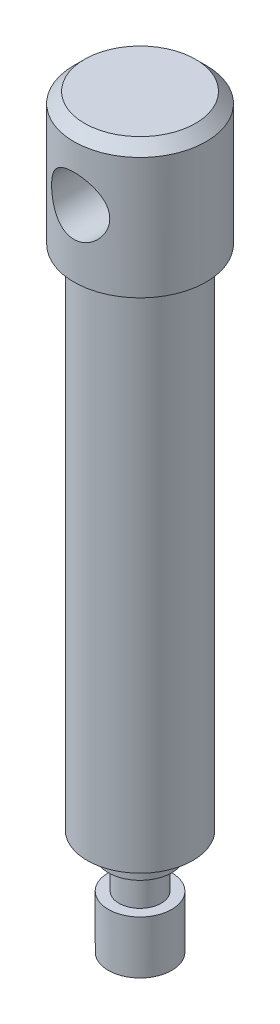
ISO-10303-21;
HEADER;
FILE_DESCRIPTION(('STEP AP214'),'2;1');
FILE_NAME('part.step','',(''),(''),'','','');
FILE_SCHEMA(('AUTOMOTIVE_DESIGN { 1 0 10303 214 1 1 1 1 }'));
ENDSEC;
DATA;
#1=APPLICATION_CONTEXT('core data for automotive mechanical design processes');
#2=APPLICATION_PROTOCOL_DEFINITION('international standard','automotive_design',2000,#1);
#3=PRODUCT_CONTEXT('',#1,'mechanical');
#4=PRODUCT('Part','Part','',(#3));
#5=PRODUCT_RELATED_PRODUCT_CATEGORY('part','',(#4));
#6=PRODUCT_DEFINITION_FORMATION('','',#4);
#7=PRODUCT_DEFINITION_CONTEXT('part definition',#1,'design');
#8=PRODUCT_DEFINITION('design','',#6,#7);
#9=PRODUCT_DEFINITION_SHAPE('','',#8);
#10=(LENGTH_UNIT() NAMED_UNIT(*) SI_UNIT(.MILLI.,.METRE.));
#11=(NAMED_UNIT(*) PLANE_ANGLE_UNIT() SI_UNIT($,.RADIAN.));
#12=(NAMED_UNIT(*) SI_UNIT($,.STERADIAN.) SOLID_ANGLE_UNIT());
#13=UNCERTAINTY_MEASURE_WITH_UNIT(LENGTH_MEASURE(1.E-05),#10,'distance_accuracy_value','');
#14=(GEOMETRIC_REPRESENTATION_CONTEXT(3) GLOBAL_UNCERTAINTY_ASSIGNED_CONTEXT((#13)) GLOBAL_UNIT_ASSIGNED_CONTEXT((#10,
#11,#12)) REPRESENTATION_CONTEXT('',''));
#15=CARTESIAN_POINT('',(0.,0.,0.));
#16=DIRECTION('',(0.,0.,1.));
#17=DIRECTION('',(1.,0.,0.));
#18=AXIS2_PLACEMENT_3D('',#15,#16,#17);
#19=CARTESIAN_POINT('',(0.,0.,0.));
#20=DIRECTION('',(0.,1.,0.));
#21=DIRECTION('',(0.,0.,1.));
#22=AXIS2_PLACEMENT_3D('',#19,#20,#21);
#23=CONICAL_SURFACE('',#22,0.,1.04719755119659);
#24=CARTESIAN_POINT('',(0.,3.4641016151378,0.));
#25=DIRECTION('',(0.,-1.,0.));
#26=DIRECTION('',(0.,0.,-1.));
#27=AXIS2_PLACEMENT_3D('',#24,#25,#26);
#28=CIRCLE('',#27,6.);
#29=CARTESIAN_POINT('',(0.,3.4641016151378,-6.));
#30=VERTEX_POINT('',#29);
#31=EDGE_CURVE('E49',#30,#30,#28,.T.);
#32=ORIENTED_EDGE('',*,*,#31,.T.);
#33=EDGE_LOOP('',(#32));
#34=FACE_BOUND('',#33,.T.);
#35=CARTESIAN_POINT('',(0.,0.,0.));
#36=VERTEX_POINT('',#35);
#37=VERTEX_LOOP('',#36);
#38=FACE_BOUND('',#37,.T.);
#39=ADVANCED_FACE('F30',(#34,#38),#23,.T.);
#40=CARTESIAN_POINT('',(0.,0.,0.));
#41=DIRECTION('',(0.,-1.,0.));
#42=DIRECTION('',(0.,0.,-1.));
#43=AXIS2_PLACEMENT_3D('',#40,#41,#42);
#44=CYLINDRICAL_SURFACE('',#43,6.);
#45=CARTESIAN_POINT('',(0.,13.4641016151378,0.));
#46=DIRECTION('',(0.,-1.,0.));
#47=DIRECTION('',(0.,0.,-1.));
#48=AXIS2_PLACEMENT_3D('',#45,#46,#47);
#49=CIRCLE('',#48,6.);
#50=CARTESIAN_POINT('',(0.,13.4641016151378,-6.));
#51=VERTEX_POINT('',#50);
#52=EDGE_CURVE('E52',#51,#51,#49,.T.);
#53=ORIENTED_EDGE('',*,*,#52,.T.);
#54=EDGE_LOOP('',(#53));
#55=FACE_BOUND('',#54,.T.);
#56=ORIENTED_EDGE('',*,*,#31,.F.);
#57=EDGE_LOOP('',(#56));
#58=FACE_BOUND('',#57,.T.);
#59=ADVANCED_FACE('F40',(#55,#58),#44,.T.);
#60=CARTESIAN_POINT('',(6.,13.4641016151378,0.));
#61=DIRECTION('',(0.,1.,0.));
#62=DIRECTION('',(0.,0.,1.));
#63=AXIS2_PLACEMENT_3D('',#60,#61,#62);
#64=PLANE('',#63);
#65=CARTESIAN_POINT('',(0.,13.4641016151378,0.));
#66=DIRECTION('',(0.,-1.,0.));
#67=DIRECTION('',(0.,0.,-1.));
#68=AXIS2_PLACEMENT_3D('',#65,#66,#67);
#69=CIRCLE('',#68,4.);
#70=CARTESIAN_POINT('',(0.,13.4641016151378,-4.));
#71=VERTEX_POINT('',#70);
#72=EDGE_CURVE('E58',#71,#71,#69,.T.);
#73=ORIENTED_EDGE('',*,*,#72,.T.);
#74=EDGE_LOOP('',(#73));
#75=FACE_BOUND('',#74,.T.);
#76=ORIENTED_EDGE('',*,*,#52,.F.);
#77=EDGE_LOOP('',(#76));
#78=FACE_BOUND('',#77,.T.);
#79=ADVANCED_FACE('F45',(#75,#78),#64,.T.);
#80=CARTESIAN_POINT('',(0.,0.,0.));
#81=DIRECTION('',(0.,-1.,0.));
#82=DIRECTION('',(0.,0.,-1.));
#83=AXIS2_PLACEMENT_3D('',#80,#81,#82);
#84=CYLINDRICAL_SURFACE('',#83,4.);
#85=CARTESIAN_POINT('',(0.,19.4641016151378,0.));
#86=DIRECTION('',(0.,-1.,0.));
#87=DIRECTION('',(0.,0.,-1.));
#88=AXIS2_PLACEMENT_3D('',#85,#86,#87);
#89=CIRCLE('',#88,4.);
#90=CARTESIAN_POINT('',(0.,19.4641016151378,-4.));
#91=VERTEX_POINT('',#90);
#92=EDGE_CURVE('E118',#91,#91,#89,.T.);
#93=ORIENTED_EDGE('',*,*,#92,.T.);
#94=EDGE_LOOP('',(#93));
#95=FACE_BOUND('',#94,.T.);
#96=ORIENTED_EDGE('',*,*,#72,.F.);
#97=EDGE_LOOP('',(#96));
#98=FACE_BOUND('',#97,.T.);
#99=ADVANCED_FACE('F125',(#95,#98),#84,.T.);
#100=CARTESIAN_POINT('',(4.,19.4641016151378,0.));
#101=DIRECTION('',(0.,-1.,0.));
#102=DIRECTION('',(0.,0.,-1.));
#103=AXIS2_PLACEMENT_3D('',#100,#101,#102);
#104=PLANE('',#103);
#105=CARTESIAN_POINT('',(0.,19.4641016151378,0.));
#106=DIRECTION('',(0.,-1.,0.));
#107=DIRECTION('',(0.,0.,-1.));
#108=AXIS2_PLACEMENT_3D('',#105,#106,#107);
#109=CIRCLE('',#108,6.);
#110=CARTESIAN_POINT('',(0.,19.4641016151378,-6.));
#111=VERTEX_POINT('',#110);
#112=EDGE_CURVE('E115',#111,#111,#109,.T.);
#113=ORIENTED_EDGE('',*,*,#112,.T.);
#114=EDGE_LOOP('',(#113));
#115=FACE_BOUND('',#114,.T.);
#116=ORIENTED_EDGE('',*,*,#92,.F.);
#117=EDGE_LOOP('',(#116));
#118=FACE_BOUND('',#117,.T.);
#119=ADVANCED_FACE('F127',(#115,#118),#104,.T.);
#120=CARTESIAN_POINT('',(0.,0.,0.));
#121=DIRECTION('',(0.,-1.,0.));
#122=DIRECTION('',(0.,0.,-1.));
#123=AXIS2_PLACEMENT_3D('',#120,#121,#122);
#124=CYLINDRICAL_SURFACE('',#123,6.);
#125=CARTESIAN_POINT('',(0.,23.4641016151378,0.));
#126=DIRECTION('',(0.,-1.,0.));
#127=DIRECTION('',(0.,0.,-1.));
#128=AXIS2_PLACEMENT_3D('',#125,#126,#127);
#129=CIRCLE('',#128,6.);
#130=CARTESIAN_POINT('',(0.,23.4641016151378,-6.));
#131=VERTEX_POINT('',#130);
#132=EDGE_CURVE('E112',#131,#131,#129,.T.);
#133=ORIENTED_EDGE('',*,*,#132,.T.);
#134=EDGE_LOOP('',(#133));
#135=FACE_BOUND('',#134,.T.);
#136=ORIENTED_EDGE('',*,*,#112,.F.);
#137=EDGE_LOOP('',(#136));
#138=FACE_BOUND('',#137,.T.);
#139=ADVANCED_FACE('F134',(#135,#138),#124,.T.);
#140=CARTESIAN_POINT('',(6.,23.4641016151378,0.));
#141=DIRECTION('',(0.,-1.,0.));
#142=DIRECTION('',(0.,0.,-1.));
#143=AXIS2_PLACEMENT_3D('',#140,#141,#142);
#144=PLANE('',#143);
#145=CARTESIAN_POINT('',(0.,23.4641016151378,0.));
#146=DIRECTION('',(0.,-1.,0.));
#147=DIRECTION('',(0.,0.,-1.));
#148=AXIS2_PLACEMENT_3D('',#145,#146,#147);
#149=CIRCLE('',#148,10.);
#150=CARTESIAN_POINT('',(0.,23.4641016151378,-10.));
#151=VERTEX_POINT('',#150);
#152=EDGE_CURVE('E107',#151,#151,#149,.T.);
#153=ORIENTED_EDGE('',*,*,#152,.T.);
#154=EDGE_LOOP('',(#153));
#155=FACE_BOUND('',#154,.T.);
#156=ORIENTED_EDGE('',*,*,#132,.F.);
#157=EDGE_LOOP('',(#156));
#158=FACE_BOUND('',#157,.T.);
#159=ADVANCED_FACE('F141',(#155,#158),#144,.T.);
#160=CARTESIAN_POINT('',(0.,0.,0.));
#161=DIRECTION('',(0.,-1.,0.));
#162=DIRECTION('',(0.,0.,-1.));
#163=AXIS2_PLACEMENT_3D('',#160,#161,#162);
#164=CYLINDRICAL_SURFACE('',#163,10.);
#165=CARTESIAN_POINT('',(0.,119.464101615138,0.));
#166=DIRECTION('',(0.,-1.,0.));
#167=DIRECTION('',(0.,0.,-1.));
#168=AXIS2_PLACEMENT_3D('',#165,#166,#167);
#169=CIRCLE('',#168,10.);
#170=CARTESIAN_POINT('',(0.,119.464101615138,-10.));
#171=VERTEX_POINT('',#170);
#172=EDGE_CURVE('E104',#171,#171,#169,.T.);
#173=ORIENTED_EDGE('',*,*,#172,.T.);
#174=EDGE_LOOP('',(#173));
#175=FACE_BOUND('',#174,.T.);
#176=ORIENTED_EDGE('',*,*,#152,.F.);
#177=EDGE_LOOP('',(#176));
#178=FACE_BOUND('',#177,.T.);
#179=ADVANCED_FACE('F145',(#175,#178),#164,.T.);
#180=CARTESIAN_POINT('',(10.,119.464101615138,0.));
#181=DIRECTION('',(0.,-1.,0.));
#182=DIRECTION('',(0.,0.,-1.));
#183=AXIS2_PLACEMENT_3D('',#180,#181,#182);
#184=PLANE('',#183);
#185=CARTESIAN_POINT('',(0.,119.464101615138,0.));
#186=DIRECTION('',(0.,-1.,0.));
#187=DIRECTION('',(0.,0.,-1.));
#188=AXIS2_PLACEMENT_3D('',#185,#186,#187);
#189=CIRCLE('',#188,12.5);
#190=CARTESIAN_POINT('',(0.,119.464101615138,-12.5));
#191=VERTEX_POINT('',#190);
#192=EDGE_CURVE('E102',#191,#191,#189,.T.);
#193=ORIENTED_EDGE('',*,*,#192,.T.);
#194=EDGE_LOOP('',(#193));
#195=FACE_BOUND('',#194,.T.);
#196=ORIENTED_EDGE('',*,*,#172,.F.);
#197=EDGE_LOOP('',(#196));
#198=FACE_BOUND('',#197,.T.);
#199=ADVANCED_FACE('F85',(#195,#198),#184,.T.);
#200=CARTESIAN_POINT('',(0.,0.,0.));
#201=DIRECTION('',(0.,-1.,0.));
#202=DIRECTION('',(0.,0.,-1.));
#203=AXIS2_PLACEMENT_3D('',#200,#201,#202);
#204=CYLINDRICAL_SURFACE('',#203,12.5);
#205=CARTESIAN_POINT('',(0.,142.464101615138,0.));
#206=DIRECTION('',(0.,1.,0.));
#207=DIRECTION('',(0.,0.,1.));
#208=AXIS2_PLACEMENT_3D('',#205,#206,#207);
#209=CIRCLE('',#208,12.5);
#210=CARTESIAN_POINT('',(0.,142.464101615138,12.5));
#211=VERTEX_POINT('',#210);
#212=EDGE_CURVE('E36',#211,#211,#209,.F.);
#213=ORIENTED_EDGE('',*,*,#212,.T.);
#214=EDGE_LOOP('',(#213));
#215=FACE_BOUND('',#214,.T.);
#216=CARTESIAN_POINT('',(0.,137.464101615138,-12.5));
#217=CARTESIAN_POINT('',(0.146639382961199,137.46410051969,-12.4999990919958));
#218=CARTESIAN_POINT('',(0.293318154375735,137.458229402566,-12.4974127771437));
#219=CARTESIAN_POINT('',(0.585621654571722,137.434802364007,-12.4871317421033));
#220=CARTESIAN_POINT('',(0.731245720812138,137.417239649683,-12.4794340521813));
#221=CARTESIAN_POINT('',(1.0205725362091,137.370573742282,-12.4591130768074));
#222=CARTESIAN_POINT('',(1.164271093875,137.341448614855,-12.4464804302809));
#223=CARTESIAN_POINT('',(1.44848793570787,137.271954204639,-12.4166145150962));
#224=CARTESIAN_POINT('',(1.58900489436773,137.231580325355,-12.3993793658706));
#225=CARTESIAN_POINT('',(1.86531961969119,137.140168401927,-12.3608234307194));
#226=CARTESIAN_POINT('',(2.00113395618486,137.089173481254,-12.3395191942293));
#227=CARTESIAN_POINT('',(2.26781794521037,136.976882070196,-12.2933054447269));
#228=CARTESIAN_POINT('',(2.39868572339155,136.91558172187,-12.268394582024));
#229=CARTESIAN_POINT('',(2.7825484085992,136.717021299416,-12.1891528370919));
#230=CARTESIAN_POINT('',(3.02715457986596,136.564984391274,-12.1302614080197));
#231=CARTESIAN_POINT('',(3.50004387600374,136.217364938635,-12.0026174358568));
#232=CARTESIAN_POINT('',(3.72689905043988,136.019985008159,-11.9335190381105));
#233=CARTESIAN_POINT('',(4.14565509209934,135.590853911844,-11.7945843685197));
#234=CARTESIAN_POINT('',(4.33753553398595,135.359082803871,-11.7247476905427));
#235=CARTESIAN_POINT('',(4.60042581643017,134.982604807433,-11.6230643669958));
#236=CARTESIAN_POINT('',(4.68578480105142,134.848337597416,-11.5888235337291));
#237=CARTESIAN_POINT('',(4.84480453726133,134.572393911542,-11.5232483525484));
#238=CARTESIAN_POINT('',(4.91847016863593,134.430720559347,-11.4919127945086));
#239=CARTESIAN_POINT('',(5.05346000363175,134.140822916925,-11.4331958999344));
#240=CARTESIAN_POINT('',(5.11478407703122,133.992598557596,-11.4058146051242));
#241=CARTESIAN_POINT('',(5.22443162315176,133.690683729316,-11.3560091071692));
#242=CARTESIAN_POINT('',(5.27276203714546,133.536996228683,-11.3335822584827));
#243=CARTESIAN_POINT('',(5.3537412966475,133.233300525852,-11.2955457027421));
#244=CARTESIAN_POINT('',(5.38706906362718,133.083509896026,-11.2796446029338));
#245=CARTESIAN_POINT('',(5.44112526743264,132.781238592768,-11.2536686806615));
#246=CARTESIAN_POINT('',(5.46185973185658,132.628759242272,-11.2435910709824));
#247=CARTESIAN_POINT('',(5.49047475552749,132.322365919958,-11.2296456624185));
#248=CARTESIAN_POINT('',(5.49835959882679,132.168452443496,-11.2257757938851));
#249=CARTESIAN_POINT('',(5.50117916405868,131.860483126277,-11.2243945175479));
#250=CARTESIAN_POINT('',(5.49611469202428,131.706427294977,-11.226882713985));
#251=CARTESIAN_POINT('',(5.47411929509198,131.412982269901,-11.2376219320427));
#252=CARTESIAN_POINT('',(5.45826761109952,131.273491313424,-11.2453486105443));
#253=CARTESIAN_POINT('',(5.41602008531488,130.996439593445,-11.2657568065911));
#254=CARTESIAN_POINT('',(5.38962082992661,130.858879469769,-11.2784399282011));
#255=CARTESIAN_POINT('',(5.32655490299109,130.586668394901,-11.3083610330218));
#256=CARTESIAN_POINT('',(5.28989035098446,130.452016849334,-11.3255980759143));
#257=CARTESIAN_POINT('',(5.20664408045846,130.186389282142,-11.364108068634));
#258=CARTESIAN_POINT('',(5.16005851967097,130.055414706865,-11.3853825817686));
#259=CARTESIAN_POINT('',(5.00373456797059,129.66350196128,-11.4553883060799));
#260=CARTESIAN_POINT('',(4.87878948855266,129.409423502848,-11.5096215236993));
#261=CARTESIAN_POINT('',(4.59267512645531,128.924911817978,-11.6267428833529));
#262=CARTESIAN_POINT('',(4.43149073032541,128.694488515389,-11.6896346321358));
#263=CARTESIAN_POINT('',(4.0594752691612,128.240560599769,-11.8242722566892));
#264=CARTESIAN_POINT('',(3.84537725977203,128.019806741833,-11.8962908236294));
#265=CARTESIAN_POINT('',(3.38241134031739,127.616287475134,-12.0360945955485));
#266=CARTESIAN_POINT('',(3.13353336140132,127.433533105532,-12.1038785663533));
#267=CARTESIAN_POINT('',(2.73484422896271,127.189594171068,-12.197955635025));
#268=CARTESIAN_POINT('',(2.59555266683755,127.112446307419,-12.2284231149523));
#269=CARTESIAN_POINT('',(2.3101866103929,126.970264442896,-12.2855264277796));
#270=CARTESIAN_POINT('',(2.1641149330268,126.905225466405,-12.312163833452));
#271=CARTESIAN_POINT('',(1.86623540306826,126.787926412109,-12.3608229376582));
#272=CARTESIAN_POINT('',(1.71442915541154,126.735662789009,-12.3828459165011));
#273=CARTESIAN_POINT('',(1.40620435262899,126.644476803321,-12.4216223606231));
#274=CARTESIAN_POINT('',(1.24978619539292,126.605553293459,-12.4383762790407));
#275=CARTESIAN_POINT('',(0.944540398658032,126.543732847631,-12.4651385183824));
#276=CARTESIAN_POINT('',(0.795932182180448,126.519916565833,-12.4755320320676));
#277=CARTESIAN_POINT('',(0.496993254790921,126.484535302618,-12.4910124588164));
#278=CARTESIAN_POINT('',(0.346662652975796,126.472969549536,-12.4960997061237));
#279=CARTESIAN_POINT('',(0.0455158887639267,126.462226995002,-12.500824024475));
#280=CARTESIAN_POINT('',(-0.105300128619766,126.463046784953,-12.5004625950366));
#281=CARTESIAN_POINT('',(-0.406241968417488,126.477057215563,-12.4943033507183));
#282=CARTESIAN_POINT('',(-0.556367809486117,126.490247519863,-12.4885056836515));
#283=CARTESIAN_POINT('',(-0.846230612738622,126.527740739585,-12.472119095482));
#284=CARTESIAN_POINT('',(-0.986072215267376,126.551367818482,-12.4618219233662));
#285=CARTESIAN_POINT('',(-1.26317698191446,126.609250814838,-12.4367900470452));
#286=CARTESIAN_POINT('',(-1.40043929709516,126.643510168961,-12.4220539080804));
#287=CARTESIAN_POINT('',(-1.67142388581645,126.72232322341,-12.3885014383697));
#288=CARTESIAN_POINT('',(-1.80514716883488,126.766873952155,-12.3696862855137));
#289=CARTESIAN_POINT('',(-2.068314722517,126.865879166605,-12.3284167389751));
#290=CARTESIAN_POINT('',(-2.19775733822885,126.920337430971,-12.3059609571402));
#291=CARTESIAN_POINT('',(-2.58637611104931,127.10160451565,-12.232388936427));
#292=CARTESIAN_POINT('',(-2.83756706974256,127.243897436248,-12.1761319220311));
#293=CARTESIAN_POINT('',(-3.31328248718942,127.564708770043,-12.0553981561847));
#294=CARTESIAN_POINT('',(-3.53779531725528,127.743242889198,-11.9909178454989));
#295=CARTESIAN_POINT('',(-3.97266163292822,128.147949308319,-11.8542772885358));
#296=CARTESIAN_POINT('',(-4.18048852552508,128.376773458049,-11.7819130945979));
#297=CARTESIAN_POINT('',(-4.55567668952969,128.867163375305,-11.6419938703006));
#298=CARTESIAN_POINT('',(-4.72302452075205,129.128739973935,-11.5744404424892));
#299=CARTESIAN_POINT('',(-4.94148703001357,129.543981465643,-11.4820792572116));
#300=CARTESIAN_POINT('',(-5.00944997206298,129.687949856389,-11.4525092108172));
#301=CARTESIAN_POINT('',(-5.13287060587781,129.98192819532,-11.3977278403932));
#302=CARTESIAN_POINT('',(-5.18833381352246,130.1319354441,-11.372514594946));
#303=CARTESIAN_POINT('',(-5.28612668824463,130.436851587507,-11.3273901888091));
#304=CARTESIAN_POINT('',(-5.32846374941774,130.591757668173,-11.3074760439801));
#305=CARTESIAN_POINT('',(-5.39951781766005,130.905311773321,-11.2737199274755));
#306=CARTESIAN_POINT('',(-5.4282363204825,131.063959384852,-11.2598772889669));
#307=CARTESIAN_POINT('',(-5.4698406584516,131.370222752668,-11.2397209947267));
#308=CARTESIAN_POINT('',(-5.48384952593483,131.517651802295,-11.232874598439));
#309=CARTESIAN_POINT('',(-5.49992508511318,131.813311698718,-11.2250125531146));
#310=CARTESIAN_POINT('',(-5.5019925144571,131.961542495421,-11.2239965439221));
#311=CARTESIAN_POINT('',(-5.49415973642309,132.257582847785,-11.227832683912));
#312=CARTESIAN_POINT('',(-5.48426164027891,132.405392473148,-11.2326837978814));
#313=CARTESIAN_POINT('',(-5.45262810283322,132.699434208771,-11.2480733680148));
#314=CARTESIAN_POINT('',(-5.43089283022985,132.845666341483,-11.2586117431264));
#315=CARTESIAN_POINT('',(-5.37744521930289,133.127017877087,-11.2842326244912));
#316=CARTESIAN_POINT('',(-5.34638619955303,133.262289174604,-11.2990154135121));
#317=CARTESIAN_POINT('',(-5.27430996899169,133.529620205407,-11.3328385293797));
#318=CARTESIAN_POINT('',(-5.2332895706919,133.661678895799,-11.3518802188548));
#319=CARTESIAN_POINT('',(-5.09581073855196,134.051831468213,-11.4145927043071));
#320=CARTESIAN_POINT('',(-4.9848979175954,134.304092757445,-11.4638695067249));
#321=CARTESIAN_POINT('',(-4.71978063818499,134.802868764878,-11.5756461915238));
#322=CARTESIAN_POINT('',(-4.56327347711196,135.048000215164,-11.6387872605327));
#323=CARTESIAN_POINT('',(-4.21426117353745,135.510051081674,-11.7696489403248));
#324=CARTESIAN_POINT('',(-4.02174138338204,135.726958957251,-11.8373714073501));
#325=CARTESIAN_POINT('',(-3.70026878178454,136.036289219484,-11.9403590807349));
#326=CARTESIAN_POINT('',(-3.58246341285294,136.1403070533,-11.9763161086025));
#327=CARTESIAN_POINT('',(-3.33812094520559,136.338072325032,-12.046704354292));
#328=CARTESIAN_POINT('',(-3.21158694176877,136.431823373468,-12.0811361059547));
#329=CARTESIAN_POINT('',(-2.95037782942927,136.608470187416,-12.1475698075784));
#330=CARTESIAN_POINT('',(-2.8156952563378,136.691355773082,-12.1795694672867));
#331=CARTESIAN_POINT('',(-2.53916491562741,136.845461954057,-12.2402067919168));
#332=CARTESIAN_POINT('',(-2.39732050030487,136.916687941929,-12.2688460092976));
#333=CARTESIAN_POINT('',(-2.10905276459763,137.046085707455,-12.3216522174196));
#334=CARTESIAN_POINT('',(-1.96270298577672,137.104401262763,-12.3458678777071));
#335=CARTESIAN_POINT('',(-1.66496318267277,137.20840779445,-12.3895326281017));
#336=CARTESIAN_POINT('',(-1.51357561837442,137.254104834045,-12.4089840069441));
#337=CARTESIAN_POINT('',(-1.20724269501743,137.332294671118,-12.4425179160448));
#338=CARTESIAN_POINT('',(-1.05230684852083,137.364819203989,-12.4566133448073));
#339=CARTESIAN_POINT('',(-0.739877601012884,137.416405491818,-12.47906540951));
#340=CARTESIAN_POINT('',(-0.582386072594319,137.43547668566,-12.4874260688604));
#341=CARTESIAN_POINT('',(-0.353758373712963,137.453169918252,-12.4951932059168));
#342=CARTESIAN_POINT('',(-0.28308490750393,137.457267787853,-12.4969943952127));
#343=CARTESIAN_POINT('',(-0.14161068987875,137.462733914446,-12.4993980174853));
#344=CARTESIAN_POINT('',(-0.0708099371954935,137.464102144113,-12.5000004384615));
#345=CARTESIAN_POINT('',(0.,137.464101615138,-12.5));
#346=B_SPLINE_CURVE_WITH_KNOTS('',3,(#216,#217,#218,#219,#220,#221,#222,#223,#224,#225,#226,
#227,#228,#229,#230,#231,#232,#233,#234,#235,#236,#237,#238,#239,#240,#241,#242,#243,#244,#245,
#246,#247,#248,#249,#250,#251,#252,#253,#254,#255,#256,#257,#258,#259,#260,#261,#262,#263,#264,
#265,#266,#267,#268,#269,#270,#271,#272,#273,#274,#275,#276,#277,#278,#279,#280,#281,#282,#283,
#284,#285,#286,#287,#288,#289,#290,#291,#292,#293,#294,#295,#296,#297,#298,#299,#300,#301,#302,
#303,#304,#305,#306,#307,#308,#309,#310,#311,#312,#313,#314,#315,#316,#317,#318,#319,#320,#321,
#322,#323,#324,#325,#326,#327,#328,#329,#330,#331,#332,#333,#334,#335,#336,#337,#338,#339,#340,
#341,#342,#343,#344,#345),.UNSPECIFIED.,.T.,.F.,(4,2,2,2,2,2,2,2,2,2,2,2,2,2,2,2,2,2,2,2,2,2,2,
2,2,2,2,2,2,2,2,2,2,2,2,2,2,2,2,2,2,2,2,2,2,2,2,2,2,2,2,2,2,2,2,2,2,2,2,2,2,2,2,2,4),(0.,
0.439846896635045,0.879949570329761,1.32089115648199,1.76201318631245,2.20137792196694,
2.64090750604861,3.51885611338797,4.44070823623367,5.36309701021099,5.85082579480174,
6.3383505057806,6.82588036059962,7.31314925488694,7.77534632926129,8.23732200514072,
8.69914362720426,9.16093650377829,9.58224460334833,10.0036891648679,10.4250467721589,
10.846567863096,11.7075328574956,12.568857581862,13.5122441651813,14.4559044282286,
14.9417259055645,15.4273473130978,15.9128338021932,16.3982785280879,16.8502809850181,
17.30225496843,17.7541045674196,18.2059418808201,18.6320401402669,19.0582762709277,
19.4843894816695,19.9106655508824,20.7889739925331,21.6676638851105,22.6158909492907,
23.5644324206487,24.0496707619813,24.5346945563763,25.0194446332887,25.5041414568011,
25.9483117471379,26.3924545998084,26.8365190979981,27.2805772677447,27.6988256690068,
28.1172080800988,28.9533936994914,29.8427032161916,30.7323752372297,31.2155464216096,
31.6985471398147,32.1819971953139,32.6652230195462,33.1427614141817,33.6200699499873,
34.0962216068891,34.5720388618024,34.7844321405895,34.9968275455443),.UNSPECIFIED.);
#347=CARTESIAN_POINT('',(0.,137.464101615138,-12.5));
#348=VERTEX_POINT('',#347);
#349=EDGE_CURVE('E55',#348,#348,#346,.T.);
#350=ORIENTED_EDGE('',*,*,#349,.F.);
#351=EDGE_LOOP('',(#350));
#352=FACE_BOUND('',#351,.T.);
#353=CARTESIAN_POINT('',(5.5,131.964101615138,11.2249721603218));
#354=CARTESIAN_POINT('',(5.49999884770547,132.109965901957,11.2249734351853));
#355=CARTESIAN_POINT('',(5.49418903021214,132.255872063922,11.2278252005178));
#356=CARTESIAN_POINT('',(5.47101232667634,132.546607565965,11.2391363031221));
#357=CARTESIAN_POINT('',(5.45363845348111,132.691436201459,11.247599030598));
#358=CARTESIAN_POINT('',(5.40748979701105,132.979148501887,11.2698584884825));
#359=CARTESIAN_POINT('',(5.37869231970294,133.122027706094,11.2836658351356));
#360=CARTESIAN_POINT('',(5.31000648388132,133.404582323564,11.3161509316212));
#361=CARTESIAN_POINT('',(5.27011342095027,133.544256350612,11.3348307471225));
#362=CARTESIAN_POINT('',(5.17986046601167,133.818775305694,11.3763569333846));
#363=CARTESIAN_POINT('',(5.12955240006261,133.953640408906,11.3991826074639));
#364=CARTESIAN_POINT('',(5.01880005794709,134.218492887786,11.4483761765637));
#365=CARTESIAN_POINT('',(4.95835190183566,134.348478372956,11.4747454267064));
#366=CARTESIAN_POINT('',(4.76255263964395,134.729897238902,11.5580363005808));
#367=CARTESIAN_POINT('',(4.61263958803655,134.973116034501,11.6191927504623));
#368=CARTESIAN_POINT('',(4.26738460516926,135.447044725358,11.7505589573178));
#369=CARTESIAN_POINT('',(4.0697717815877,135.675994908667,11.8210965384448));
#370=CARTESIAN_POINT('',(3.63923797985084,136.098938110022,11.9606436914299));
#371=CARTESIAN_POINT('',(3.40630251603595,136.29291671461,12.0296526230276));
#372=CARTESIAN_POINT('',(3.02827235286859,136.558110572512,12.1283867246326));
#373=CARTESIAN_POINT('',(2.89397140693482,136.6438894809,12.1612090108564));
#374=CARTESIAN_POINT('',(2.61787727862233,136.80374251872,12.223612581678));
#375=CARTESIAN_POINT('',(2.4760870297448,136.877821186338,12.253195121508));
#376=CARTESIAN_POINT('',(2.18595913598592,137.013580604271,12.308265046126));
#377=CARTESIAN_POINT('',(2.03762259031471,137.075263426424,12.33375311512));
#378=CARTESIAN_POINT('',(1.73544960887244,137.185602876902,12.3798853499406));
#379=CARTESIAN_POINT('',(1.58161360953319,137.234260536302,12.4005298991657));
#380=CARTESIAN_POINT('',(1.27859166635513,137.31558620091,12.4353172963261));
#381=CARTESIAN_POINT('',(1.12964322559774,137.349009742611,12.4497645468914));
#382=CARTESIAN_POINT('',(0.829079946174318,137.403398009801,12.4733854052628));
#383=CARTESIAN_POINT('',(0.67746530278983,137.424363643869,12.4825593976555));
#384=CARTESIAN_POINT('',(0.372838738570998,137.453582114183,12.4953680870592));
#385=CARTESIAN_POINT('',(0.219827351849195,137.461839620701,12.4990048190231));
#386=CARTESIAN_POINT('',(-0.0863778731984319,137.465554090556,12.5006390031796));
#387=CARTESIAN_POINT('',(-0.239571703155749,137.461011620001,12.4986367047713));
#388=CARTESIAN_POINT('',(-0.534479303806771,137.439928399787,12.4893794562587));
#389=CARTESIAN_POINT('',(-0.676265374083268,137.42422450536,12.4824909310266));
#390=CARTESIAN_POINT('',(-0.957938485123453,137.381909490836,12.4640394439173));
#391=CARTESIAN_POINT('',(-1.09782489883098,137.355294855491,12.45247497555));
#392=CARTESIAN_POINT('',(-1.37465605510795,137.291436162477,12.4249613461566));
#393=CARTESIAN_POINT('',(-1.51160175174769,137.254195610007,12.4090136311072));
#394=CARTESIAN_POINT('',(-1.78177859402749,137.169418327041,12.3731098837317));
#395=CARTESIAN_POINT('',(-1.91500830181867,137.12187767178,12.3531523236994));
#396=CARTESIAN_POINT('',(-2.17886809415096,137.016133600499,12.3093734943991));
#397=CARTESIAN_POINT('',(-2.30943016898471,136.957782290779,12.2854992375924));
#398=CARTESIAN_POINT('',(-2.56516043475226,136.831372539882,12.2346632102896));
#399=CARTESIAN_POINT('',(-2.69032663892982,136.76331056233,12.2077003156992));
#400=CARTESIAN_POINT('',(-3.05670718390398,136.545279929948,12.123085226232));
#401=CARTESIAN_POINT('',(-3.28896726484586,136.38140046417,12.0616782883599));
#402=CARTESIAN_POINT('',(-3.74158492320574,136.006816836191,11.9293964202791));
#403=CARTESIAN_POINT('',(-3.95963480197055,135.793472435989,11.8581565384261));
#404=CARTESIAN_POINT('',(-4.35803745928775,135.333086719253,11.7176006760157));
#405=CARTESIAN_POINT('',(-4.53837219266091,135.086029365417,11.6482856301066));
#406=CARTESIAN_POINT('',(-4.78009760449335,134.689178208726,11.5502669073709));
#407=CARTESIAN_POINT('',(-4.85707008524071,134.54952224687,11.5180218695961));
#408=CARTESIAN_POINT('',(-4.99885655428661,134.263423566767,11.4571976088772));
#409=CARTESIAN_POINT('',(-5.06367557981789,134.116983691767,11.4286168687547));
#410=CARTESIAN_POINT('',(-5.18049248677231,133.818340777167,11.3761418586993));
#411=CARTESIAN_POINT('',(-5.23249595997609,133.666140284644,11.3522455457552));
#412=CARTESIAN_POINT('',(-5.32312136116178,133.357049693897,11.3100346345866));
#413=CARTESIAN_POINT('',(-5.36174464974017,133.200160074262,11.2917194688523));
#414=CARTESIAN_POINT('',(-5.42289357245669,132.894077623469,11.2624727039808));
#415=CARTESIAN_POINT('',(-5.44635473954129,132.745112049568,11.2511149231446));
#416=CARTESIAN_POINT('',(-5.48097320846719,132.445431831029,11.2342915427309));
#417=CARTESIAN_POINT('',(-5.49213148998311,132.294717326623,11.2288254739992));
#418=CARTESIAN_POINT('',(-5.50199729955742,131.992835540498,11.2239946642097));
#419=CARTESIAN_POINT('',(-5.50070912098336,131.841668432889,11.2246278192436));
#420=CARTESIAN_POINT('',(-5.48571050348781,131.54010654503,11.2319655074847));
#421=CARTESIAN_POINT('',(-5.47200053317996,131.38971173586,11.2386698116571));
#422=CARTESIAN_POINT('',(-5.43383012851095,131.102181361339,11.257171155604));
#423=CARTESIAN_POINT('',(-5.4102569185629,130.964900110694,11.2685467089964));
#424=CARTESIAN_POINT('',(-5.35289620944869,130.692943068927,11.2959061923654));
#425=CARTESIAN_POINT('',(-5.31910546067424,130.558268121239,11.3118915883913));
#426=CARTESIAN_POINT('',(-5.2028709732722,130.15947953855,11.3660700789536));
#427=CARTESIAN_POINT('',(-5.10553650826352,129.900391351036,11.4105001716331));
#428=CARTESIAN_POINT('',(-4.86926821846438,129.390632704846,11.5133583703101));
#429=CARTESIAN_POINT('',(-4.72867854952625,129.14084743026,11.572320618129));
#430=CARTESIAN_POINT('',(-4.41148815437447,128.667114571596,11.696915567156));
#431=CARTESIAN_POINT('',(-4.23487068436394,128.443179077164,11.7625513627327));
#432=CARTESIAN_POINT('',(-3.8312124717608,128.005788054132,11.9004709177411));
#433=CARTESIAN_POINT('',(-3.60101454340326,127.795230343163,11.9728067054778));
#434=CARTESIAN_POINT('',(-3.23078835688785,127.510298615547,12.0759487782241));
#435=CARTESIAN_POINT('',(-3.1031370291362,127.420425624783,12.1094551568245));
#436=CARTESIAN_POINT('',(-2.84019416391194,127.251600513385,12.1738068638457));
#437=CARTESIAN_POINT('',(-2.70490595907556,127.172643680175,12.2046533383863));
#438=CARTESIAN_POINT('',(-2.42638196271899,127.025714434557,12.2630781800778));
#439=CARTESIAN_POINT('',(-2.28309122062564,126.957835010752,12.2906284097678));
#440=CARTESIAN_POINT('',(-1.99057724073719,126.834503288871,12.3413783678723));
#441=CARTESIAN_POINT('',(-1.84135658709185,126.779045646035,12.3645799666825));
#442=CARTESIAN_POINT('',(-1.53807748217905,126.681138412368,12.4059554620578));
#443=CARTESIAN_POINT('',(-1.38402063334261,126.638684561967,12.4241310047863));
#444=CARTESIAN_POINT('',(-1.07226738648505,126.567268477013,12.4549093538234));
#445=CARTESIAN_POINT('',(-0.9145713028361,126.538305081643,12.4675126396046));
#446=CARTESIAN_POINT('',(-0.609040578561957,126.495920169486,12.4860192418203));
#447=CARTESIAN_POINT('',(-0.461372949083816,126.481480342859,12.492360857508));
#448=CARTESIAN_POINT('',(-0.165224426998486,126.464583945999,12.4997854234493));
#449=CARTESIAN_POINT('',(-0.0167435757004117,126.462126772636,12.5008686383778));
#450=CARTESIAN_POINT('',(0.279845228914014,126.469223384112,12.4977468737045));
#451=CARTESIAN_POINT('',(0.427953247844766,126.478774882254,12.4935429008919));
#452=CARTESIAN_POINT('',(0.722675042284055,126.509773210042,12.4799641523417));
#453=CARTESIAN_POINT('',(0.869288833687951,126.531219913013,12.4705894316684));
#454=CARTESIAN_POINT('',(1.15365557328829,126.584595187095,12.4474308759103));
#455=CARTESIAN_POINT('',(1.29151793805997,126.616031711521,12.433854673791));
#456=CARTESIAN_POINT('',(1.56399044316718,126.689268341996,12.4025313739453));
#457=CARTESIAN_POINT('',(1.69859950979935,126.7310718196,12.3847829194109));
#458=CARTESIAN_POINT('',(2.09621504473322,126.871485096608,12.325884051352));
#459=CARTESIAN_POINT('',(2.35324171549059,126.985141824589,12.2790602353409));
#460=CARTESIAN_POINT('',(2.85647938847978,127.254976955563,12.1720942323575));
#461=CARTESIAN_POINT('',(3.10165522753495,127.412865053438,12.1114401111208));
#462=CARTESIAN_POINT('',(3.56312431607819,127.764297455869,11.9838024418842));
#463=CARTESIAN_POINT('',(3.77940548370818,127.957856595727,11.9168162660999));
#464=CARTESIAN_POINT('',(4.19440456150715,128.392825214507,11.777457686499));
#465=CARTESIAN_POINT('',(4.39048492711959,128.636772564768,11.7050679797765));
#466=CARTESIAN_POINT('',(4.65205824044127,129.025921585379,11.602464526072));
#467=CARTESIAN_POINT('',(4.73388242479005,129.159637151436,11.5692336305272));
#468=CARTESIAN_POINT('',(4.88606801669805,129.434097638976,11.5057864889834));
#469=CARTESIAN_POINT('',(4.95643460501909,129.574839345637,11.4755688828793));
#470=CARTESIAN_POINT('',(5.08526771013663,129.862905684358,11.4190639969072));
#471=CARTESIAN_POINT('',(5.14370100807353,130.010247336909,11.3927877411263));
#472=CARTESIAN_POINT('',(5.24779937348017,130.310086738927,11.3452139262615));
#473=CARTESIAN_POINT('',(5.29347081536852,130.462581871461,11.3239138824845));
#474=CARTESIAN_POINT('',(5.3714312532325,130.771207874931,11.2871423480741));
#475=CARTESIAN_POINT('',(5.40375541031872,130.927328034055,11.2716555533699));
#476=CARTESIAN_POINT('',(5.4547460537101,131.242197853437,11.2470687879171));
#477=CARTESIAN_POINT('',(5.47342285892538,131.400945433998,11.2379639918832));
#478=CARTESIAN_POINT('',(5.49009968488262,131.627429111018,11.229818629887));
#479=CARTESIAN_POINT('',(5.49381084677033,131.694692804354,11.2280029166832));
#480=CARTESIAN_POINT('',(5.4987613001353,131.829335222504,11.2255793729342));
#481=CARTESIAN_POINT('',(5.50000053234716,131.896713950039,11.2249715713492));
#482=CARTESIAN_POINT('',(5.5,131.964101615138,11.2249721603218));
#483=B_SPLINE_CURVE_WITH_KNOTS('',3,(#353,#354,#355,#356,#357,#358,#359,#360,#361,#362,#363,
#364,#365,#366,#367,#368,#369,#370,#371,#372,#373,#374,#375,#376,#377,#378,#379,#380,#381,#382,
#383,#384,#385,#386,#387,#388,#389,#390,#391,#392,#393,#394,#395,#396,#397,#398,#399,#400,#401,
#402,#403,#404,#405,#406,#407,#408,#409,#410,#411,#412,#413,#414,#415,#416,#417,#418,#419,#420,
#421,#422,#423,#424,#425,#426,#427,#428,#429,#430,#431,#432,#433,#434,#435,#436,#437,#438,#439,
#440,#441,#442,#443,#444,#445,#446,#447,#448,#449,#450,#451,#452,#453,#454,#455,#456,#457,#458,
#459,#460,#461,#462,#463,#464,#465,#466,#467,#468,#469,#470,#471,#472,#473,#474,#475,#476,#477,
#478,#479,#480,#481,#482),.UNSPECIFIED.,.T.,.F.,(4,2,2,2,2,2,2,2,2,2,2,2,2,2,2,2,2,2,2,2,2,2,2,
2,2,2,2,2,2,2,2,2,2,2,2,2,2,2,2,2,2,2,2,2,2,2,2,2,2,2,2,2,2,2,2,2,2,2,2,2,2,2,2,2,4),(0.,
0.437522994510947,0.875310586369099,1.31397227403641,1.7528202341499,2.18953478628981,
2.62641682309985,3.49915994809214,4.42701351418117,5.35524862315768,5.84283614106997,
6.33023407096352,6.81755046936921,7.30482828025147,7.76422779981167,8.22359381042151,
8.68279096243929,9.14196780572082,9.56992179309313,9.99801376821379,10.4259646904586,
10.8540789674507,11.2885523837659,11.7231844299301,12.5919177287927,13.5278007280834,
14.4641304904547,14.9516764038355,15.4390197955978,15.9261501679361,16.4132309906928,
16.8663094374512,17.3193518031199,17.7722378988203,18.2251069100482,18.6438756726264,
19.0627777616704,19.8999498358956,20.7743104849318,21.6490784196895,22.6049706827903,
23.0835162228372,23.561854522277,24.0440218712649,24.5259813562617,25.0077827995956,
25.4895427775782,25.9344976585167,26.3794301429826,26.8242779159944,27.2691209518354,
27.6947754322175,28.1205685265276,28.9714525214858,29.8613232497499,30.7515649067959,
31.7104049070669,32.1906707048544,32.6707187349662,33.1520853935739,33.633211182828,
34.1130613166231,34.5925482540543,34.7946741260872,34.9968048441014),.UNSPECIFIED.);
#484=CARTESIAN_POINT('',(5.5,131.964101615138,11.2249721603218));
#485=VERTEX_POINT('',#484);
#486=EDGE_CURVE('E51',#485,#485,#483,.T.);
#487=ORIENTED_EDGE('',*,*,#486,.F.);
#488=EDGE_LOOP('',(#487));
#489=FACE_BOUND('',#488,.T.);
#490=ORIENTED_EDGE('',*,*,#192,.F.);
#491=EDGE_LOOP('',(#490));
#492=FACE_BOUND('',#491,.T.);
#493=ADVANCED_FACE('F68',(#215,#352,#489,#492),#204,.T.);
#494=CARTESIAN_POINT('',(12.5,144.464101615138,0.));
#495=DIRECTION('',(0.,1.,0.));
#496=DIRECTION('',(0.,0.,1.));
#497=AXIS2_PLACEMENT_3D('',#494,#495,#496);
#498=PLANE('',#497);
#499=CARTESIAN_POINT('',(0.,144.464101615138,0.));
#500=DIRECTION('',(0.,1.,0.));
#501=DIRECTION('',(0.,0.,1.));
#502=AXIS2_PLACEMENT_3D('',#499,#500,#501);
#503=CIRCLE('',#502,10.5);
#504=CARTESIAN_POINT('',(0.,144.464101615138,10.5));
#505=VERTEX_POINT('',#504);
#506=EDGE_CURVE('E11',#505,#505,#503,.T.);
#507=ORIENTED_EDGE('',*,*,#506,.T.);
#508=EDGE_LOOP('',(#507));
#509=FACE_BOUND('',#508,.T.);
#510=ADVANCED_FACE('F77',(#509),#498,.T.);
#511=CARTESIAN_POINT('',(0.,131.964101615138,-12.5));
#512=DIRECTION('',(0.,0.,1.));
#513=DIRECTION('',(1.,0.,0.));
#514=AXIS2_PLACEMENT_3D('',#511,#512,#513);
#515=CYLINDRICAL_SURFACE('',#514,5.5);
#516=ORIENTED_EDGE('',*,*,#349,.T.);
#517=EDGE_LOOP('',(#516));
#518=FACE_BOUND('',#517,.T.);
#519=ORIENTED_EDGE('',*,*,#486,.T.);
#520=EDGE_LOOP('',(#519));
#521=FACE_BOUND('',#520,.T.);
#522=ADVANCED_FACE('F72',(#518,#521),#515,.F.);
#523=CARTESIAN_POINT('',(0.,142.464101615138,0.));
#524=DIRECTION('',(0.,-1.,0.));
#525=DIRECTION('',(0.,0.,-1.));
#526=AXIS2_PLACEMENT_3D('',#523,#524,#525);
#527=CONICAL_SURFACE('',#526,12.5,0.785398163397448);
#528=ORIENTED_EDGE('',*,*,#506,.F.);
#529=EDGE_LOOP('',(#528));
#530=FACE_BOUND('',#529,.T.);
#531=ORIENTED_EDGE('',*,*,#212,.F.);
#532=EDGE_LOOP('',(#531));
#533=FACE_BOUND('',#532,.T.);
#534=ADVANCED_FACE('F76',(#530,#533),#527,.T.);
#535=CLOSED_SHELL('',(#39,#59,#79,#99,#119,#139,#159,#179,#199,#493,#510,#522,#534));
#536=MANIFOLD_SOLID_BREP('B2',#535);
#537=ADVANCED_BREP_SHAPE_REPRESENTATION('',(#18,#536),#14);
#538=SHAPE_DEFINITION_REPRESENTATION(#9,#537);
ENDSEC;
END-ISO-10303-21;
